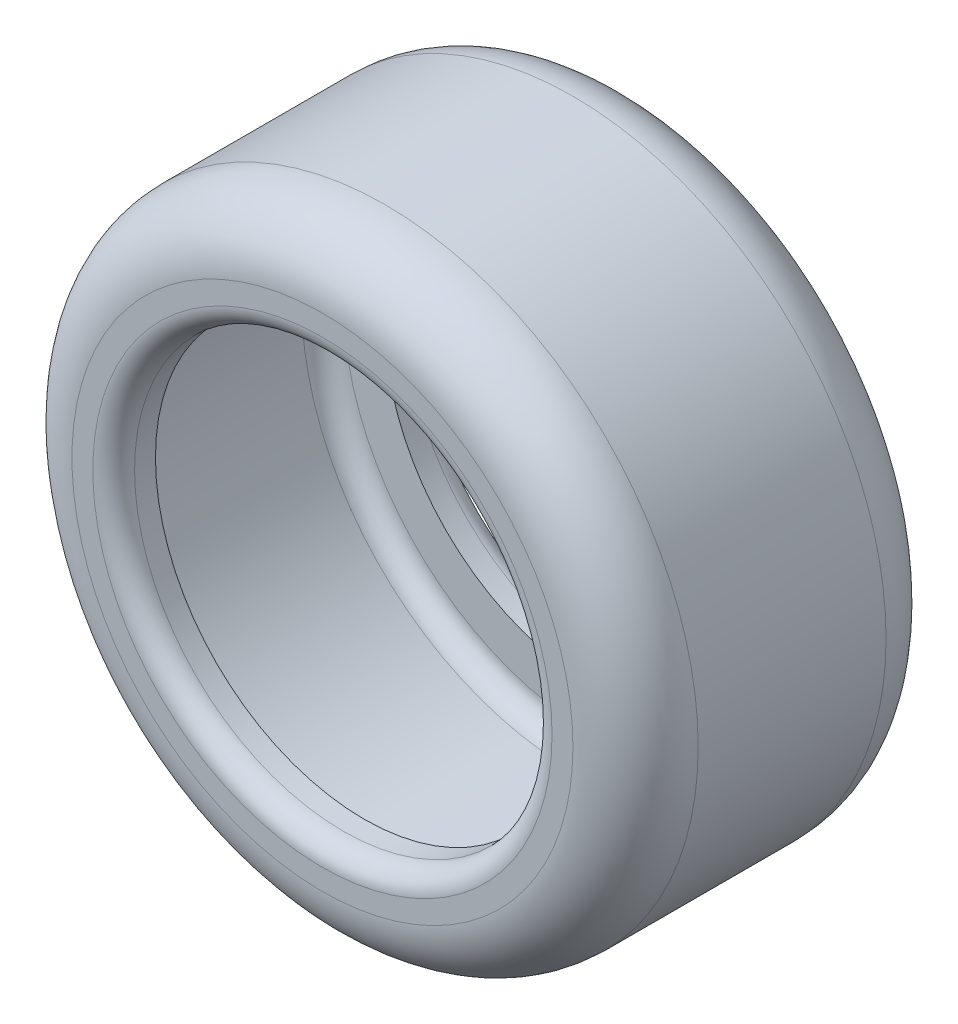
ISO-10303-21;
HEADER;
FILE_DESCRIPTION(('STEP AP214'),'2;1');
FILE_NAME('part.step','',(''),(''),'','','');
FILE_SCHEMA(('AUTOMOTIVE_DESIGN { 1 0 10303 214 1 1 1 1 }'));
ENDSEC;
DATA;
#1=APPLICATION_CONTEXT('core data for automotive mechanical design processes');
#2=APPLICATION_PROTOCOL_DEFINITION('international standard','automotive_design',2000,#1);
#3=PRODUCT_CONTEXT('',#1,'mechanical');
#4=PRODUCT('Part','Part','',(#3));
#5=PRODUCT_RELATED_PRODUCT_CATEGORY('part','',(#4));
#6=PRODUCT_DEFINITION_FORMATION('','',#4);
#7=PRODUCT_DEFINITION_CONTEXT('part definition',#1,'design');
#8=PRODUCT_DEFINITION('design','',#6,#7);
#9=PRODUCT_DEFINITION_SHAPE('','',#8);
#10=(LENGTH_UNIT() NAMED_UNIT(*) SI_UNIT(.MILLI.,.METRE.));
#11=(NAMED_UNIT(*) PLANE_ANGLE_UNIT() SI_UNIT($,.RADIAN.));
#12=(NAMED_UNIT(*) SI_UNIT($,.STERADIAN.) SOLID_ANGLE_UNIT());
#13=UNCERTAINTY_MEASURE_WITH_UNIT(LENGTH_MEASURE(1.E-05),#10,'distance_accuracy_value','');
#14=(GEOMETRIC_REPRESENTATION_CONTEXT(3) GLOBAL_UNCERTAINTY_ASSIGNED_CONTEXT((#13)) GLOBAL_UNIT_ASSIGNED_CONTEXT((#10,
#11,#12)) REPRESENTATION_CONTEXT('',''));
#15=CARTESIAN_POINT('',(0.,0.,0.));
#16=DIRECTION('',(0.,0.,1.));
#17=DIRECTION('',(1.,0.,0.));
#18=AXIS2_PLACEMENT_3D('',#15,#16,#17);
#19=CARTESIAN_POINT('',(-15.4340427457769,9.05911204643427,38.1));
#20=DIRECTION('',(0.,0.,-1.));
#21=DIRECTION('',(-1.,0.,0.));
#22=AXIS2_PLACEMENT_3D('',#19,#20,#21);
#23=CYLINDRICAL_SURFACE('',#22,25.4);
#24=CARTESIAN_POINT('',(-15.4340427457769,9.05911204643427,35.56));
#25=DIRECTION('',(0.,0.,1.));
#26=DIRECTION('',(1.,0.,0.));
#27=AXIS2_PLACEMENT_3D('',#24,#25,#26);
#28=CIRCLE('',#27,25.4);
#29=CARTESIAN_POINT('',(-40.8340427457769,9.05911204643427,35.56));
#30=VERTEX_POINT('',#29);
#31=EDGE_CURVE('E56',#30,#30,#28,.T.);
#32=CARTESIAN_POINT('',(-15.4340427457769,9.05911204643427,33.02));
#33=DIRECTION('',(0.,0.,1.));
#34=DIRECTION('',(1.,0.,0.));
#35=AXIS2_PLACEMENT_3D('',#32,#33,#34);
#36=CIRCLE('',#35,25.4);
#37=CARTESIAN_POINT('',(-40.8340427457769,9.05911204643427,33.02));
#38=VERTEX_POINT('',#37);
#39=EDGE_CURVE('E87',#38,#38,#36,.F.);
#40=CARTESIAN_POINT('',(-40.8340427457769,9.05911204643427,35.56));
#41=CARTESIAN_POINT('',(-40.8340427457769,9.05911204643427,35.5335416666667));
#42=CARTESIAN_POINT('',(-40.8340427457769,9.05911204643427,35.5070833333333));
#43=CARTESIAN_POINT('',(-40.8340427457769,9.05911204643427,35.4541666666667));
#44=CARTESIAN_POINT('',(-40.8340427457769,9.05911204643427,35.4277083333333));
#45=CARTESIAN_POINT('',(-40.8340427457769,9.05911204643427,35.3747916666667));
#46=CARTESIAN_POINT('',(-40.8340427457769,9.05911204643427,35.3483333333333));
#47=CARTESIAN_POINT('',(-40.8340427457769,9.05911204643427,35.2954166666667));
#48=CARTESIAN_POINT('',(-40.8340427457769,9.05911204643427,35.2689583333333));
#49=CARTESIAN_POINT('',(-40.8340427457769,9.05911204643427,35.2160416666667));
#50=CARTESIAN_POINT('',(-40.8340427457769,9.05911204643427,35.1895833333333));
#51=CARTESIAN_POINT('',(-40.8340427457769,9.05911204643427,35.1366666666667));
#52=CARTESIAN_POINT('',(-40.8340427457769,9.05911204643427,35.1102083333333));
#53=CARTESIAN_POINT('',(-40.8340427457769,9.05911204643427,35.0572916666667));
#54=CARTESIAN_POINT('',(-40.8340427457769,9.05911204643427,35.0308333333333));
#55=CARTESIAN_POINT('',(-40.8340427457769,9.05911204643427,34.9779166666667));
#56=CARTESIAN_POINT('',(-40.8340427457769,9.05911204643427,34.9514583333333));
#57=CARTESIAN_POINT('',(-40.8340427457769,9.05911204643427,34.8985416666667));
#58=CARTESIAN_POINT('',(-40.8340427457769,9.05911204643427,34.8720833333333));
#59=CARTESIAN_POINT('',(-40.8340427457769,9.05911204643427,34.8191666666667));
#60=CARTESIAN_POINT('',(-40.8340427457769,9.05911204643427,34.7927083333333));
#61=CARTESIAN_POINT('',(-40.8340427457769,9.05911204643427,34.7397916666667));
#62=CARTESIAN_POINT('',(-40.8340427457769,9.05911204643427,34.7133333333333));
#63=CARTESIAN_POINT('',(-40.8340427457769,9.05911204643427,34.6604166666667));
#64=CARTESIAN_POINT('',(-40.8340427457769,9.05911204643427,34.6339583333333));
#65=CARTESIAN_POINT('',(-40.8340427457769,9.05911204643427,34.5810416666667));
#66=CARTESIAN_POINT('',(-40.8340427457769,9.05911204643427,34.5545833333333));
#67=CARTESIAN_POINT('',(-40.8340427457769,9.05911204643427,34.5016666666667));
#68=CARTESIAN_POINT('',(-40.8340427457769,9.05911204643427,34.4752083333333));
#69=CARTESIAN_POINT('',(-40.8340427457769,9.05911204643427,34.4222916666667));
#70=CARTESIAN_POINT('',(-40.8340427457769,9.05911204643427,34.3958333333333));
#71=CARTESIAN_POINT('',(-40.8340427457769,9.05911204643427,34.3429166666667));
#72=CARTESIAN_POINT('',(-40.8340427457769,9.05911204643427,34.3164583333333));
#73=CARTESIAN_POINT('',(-40.8340427457769,9.05911204643427,34.2635416666667));
#74=CARTESIAN_POINT('',(-40.8340427457769,9.05911204643427,34.2370833333333));
#75=CARTESIAN_POINT('',(-40.8340427457769,9.05911204643427,34.1841666666667));
#76=CARTESIAN_POINT('',(-40.8340427457769,9.05911204643427,34.1577083333333));
#77=CARTESIAN_POINT('',(-40.8340427457769,9.05911204643427,34.1047916666667));
#78=CARTESIAN_POINT('',(-40.8340427457769,9.05911204643427,34.0783333333333));
#79=CARTESIAN_POINT('',(-40.8340427457769,9.05911204643427,34.0254166666667));
#80=CARTESIAN_POINT('',(-40.8340427457769,9.05911204643427,33.9989583333333));
#81=CARTESIAN_POINT('',(-40.8340427457769,9.05911204643427,33.9460416666667));
#82=CARTESIAN_POINT('',(-40.8340427457769,9.05911204643427,33.9195833333333));
#83=CARTESIAN_POINT('',(-40.8340427457769,9.05911204643427,33.8666666666667));
#84=CARTESIAN_POINT('',(-40.8340427457769,9.05911204643427,33.8402083333333));
#85=CARTESIAN_POINT('',(-40.8340427457769,9.05911204643427,33.7872916666667));
#86=CARTESIAN_POINT('',(-40.8340427457769,9.05911204643427,33.7608333333333));
#87=CARTESIAN_POINT('',(-40.8340427457769,9.05911204643427,33.7079166666667));
#88=CARTESIAN_POINT('',(-40.8340427457769,9.05911204643427,33.6814583333333));
#89=CARTESIAN_POINT('',(-40.8340427457769,9.05911204643427,33.6285416666667));
#90=CARTESIAN_POINT('',(-40.8340427457769,9.05911204643427,33.6020833333333));
#91=CARTESIAN_POINT('',(-40.8340427457769,9.05911204643427,33.5491666666667));
#92=CARTESIAN_POINT('',(-40.8340427457769,9.05911204643427,33.5227083333333));
#93=CARTESIAN_POINT('',(-40.8340427457769,9.05911204643427,33.4697916666667));
#94=CARTESIAN_POINT('',(-40.8340427457769,9.05911204643427,33.4433333333333));
#95=CARTESIAN_POINT('',(-40.8340427457769,9.05911204643427,33.3904166666667));
#96=CARTESIAN_POINT('',(-40.8340427457769,9.05911204643427,33.3639583333333));
#97=CARTESIAN_POINT('',(-40.8340427457769,9.05911204643427,33.3110416666667));
#98=CARTESIAN_POINT('',(-40.8340427457769,9.05911204643427,33.2845833333333));
#99=CARTESIAN_POINT('',(-40.8340427457769,9.05911204643427,33.2316666666667));
#100=CARTESIAN_POINT('',(-40.8340427457769,9.05911204643427,33.2052083333333));
#101=CARTESIAN_POINT('',(-40.8340427457769,9.05911204643427,33.1522916666667));
#102=CARTESIAN_POINT('',(-40.8340427457769,9.05911204643427,33.1258333333333));
#103=CARTESIAN_POINT('',(-40.8340427457769,9.05911204643427,33.0729166666667));
#104=CARTESIAN_POINT('',(-40.8340427457769,9.05911204643427,33.0464583333333));
#105=CARTESIAN_POINT('',(-40.8340427457769,9.05911204643427,33.02));
#106=B_SPLINE_CURVE_WITH_KNOTS('',3,(#40,#41,#42,#43,#44,#45,#46,#47,#48,#49,#50,#51,#52,#53,
#54,#55,#56,#57,#58,#59,#60,#61,#62,#63,#64,#65,#66,#67,#68,#69,#70,#71,#72,#73,#74,#75,#76,#77,
#78,#79,#80,#81,#82,#83,#84,#85,#86,#87,#88,#89,#90,#91,#92,#93,#94,#95,#96,#97,#98,#99,#100,
#101,#102,#103,#104,#105),.UNSPECIFIED.,.F.,.F.,(4,2,2,2,2,2,2,2,2,2,2,2,2,2,2,2,2,2,2,2,2,2,2,
2,2,2,2,2,2,2,2,2,4),(0.,0.0793749999999996,0.158750000000006,0.238125000000006,
0.317500000000005,0.396875000000005,0.476250000000004,0.555625000000004,0.635000000000004,
0.714375000000003,0.793750000000003,0.873125000000002,0.952500000000002,1.031875,1.11125,
1.190625,1.27,1.34937500000001,1.42875,1.50812500000001,1.58750000000001,1.66687500000001,
1.74625,1.825625,1.905,1.984375,2.06375,2.143125,2.2225,2.301875,2.38125,2.460625,2.54),.UNSPECIFIED.);
#107=EDGE_CURVE('BSEAM43',#30,#38,#106,.T.);
#108=ORIENTED_EDGE('',*,*,#31,.T.);
#109=ORIENTED_EDGE('',*,*,#39,.T.);
#110=ORIENTED_EDGE('',*,*,#107,.T.);
#111=ORIENTED_EDGE('',*,*,#107,.F.);
#112=EDGE_LOOP('',(#108,#110,#109,#111));
#113=FACE_BOUND('',#112,.T.);
#114=ADVANCED_FACE('F43',(#113),#23,.F.);
#115=CARTESIAN_POINT('',(-15.4340427457769,9.05911204643427,38.1));
#116=DIRECTION('',(0.,0.,1.));
#117=DIRECTION('',(1.,0.,0.));
#118=AXIS2_PLACEMENT_3D('',#115,#116,#117);
#119=PLANE('',#118);
#120=CARTESIAN_POINT('',(-15.4340427457769,9.05911204643427,38.1));
#121=DIRECTION('',(0.,0.,1.));
#122=DIRECTION('',(1.,0.,0.));
#123=AXIS2_PLACEMENT_3D('',#120,#121,#122);
#124=CIRCLE('',#123,27.94);
#125=CARTESIAN_POINT('',(12.5059572542231,9.05911204643427,38.1));
#126=VERTEX_POINT('',#125);
#127=EDGE_CURVE('E11',#126,#126,#124,.F.);
#128=ORIENTED_EDGE('',*,*,#127,.T.);
#129=EDGE_LOOP('',(#128));
#130=FACE_BOUND('',#129,.T.);
#131=CARTESIAN_POINT('',(-15.4340427457769,9.05911204643427,38.1));
#132=DIRECTION('',(0.,0.,1.));
#133=DIRECTION('',(1.,0.,0.));
#134=AXIS2_PLACEMENT_3D('',#131,#132,#133);
#135=CIRCLE('',#134,30.48);
#136=CARTESIAN_POINT('',(15.0459572542231,9.05911204643427,38.1));
#137=VERTEX_POINT('',#136);
#138=EDGE_CURVE('E67',#137,#137,#135,.T.);
#139=ORIENTED_EDGE('',*,*,#138,.T.);
#140=EDGE_LOOP('',(#139));
#141=FACE_BOUND('',#140,.T.);
#142=ADVANCED_FACE('F118',(#130,#141),#119,.T.);
#143=CARTESIAN_POINT('',(-15.4340427457769,9.05911204643427,0.));
#144=DIRECTION('',(0.,0.,1.));
#145=DIRECTION('',(1.,0.,0.));
#146=AXIS2_PLACEMENT_3D('',#143,#144,#145);
#147=PLANE('',#146);
#148=CARTESIAN_POINT('',(-15.4340427457769,9.05911204643427,0.));
#149=DIRECTION('',(0.,0.,1.));
#150=DIRECTION('',(1.,0.,0.));
#151=AXIS2_PLACEMENT_3D('',#148,#149,#150);
#152=CIRCLE('',#151,27.94);
#153=CARTESIAN_POINT('',(12.5059572542231,9.05911204643427,0.));
#154=VERTEX_POINT('',#153);
#155=EDGE_CURVE('E61',#154,#154,#152,.T.);
#156=ORIENTED_EDGE('',*,*,#155,.T.);
#157=EDGE_LOOP('',(#156));
#158=FACE_BOUND('',#157,.T.);
#159=CARTESIAN_POINT('',(-15.4340427457769,9.05911204643427,0.));
#160=DIRECTION('',(0.,0.,1.));
#161=DIRECTION('',(1.,0.,0.));
#162=AXIS2_PLACEMENT_3D('',#159,#160,#161);
#163=CIRCLE('',#162,30.48);
#164=CARTESIAN_POINT('',(15.0459572542231,9.05911204643427,0.));
#165=VERTEX_POINT('',#164);
#166=EDGE_CURVE('E71',#165,#165,#163,.F.);
#167=ORIENTED_EDGE('',*,*,#166,.T.);
#168=EDGE_LOOP('',(#167));
#169=FACE_BOUND('',#168,.T.);
#170=ADVANCED_FACE('F125',(#158,#169),#147,.F.);
#171=CARTESIAN_POINT('',(-15.4340427457769,9.05911204643427,38.1));
#172=DIRECTION('',(0.,0.,-1.));
#173=DIRECTION('',(-1.,0.,0.));
#174=AXIS2_PLACEMENT_3D('',#171,#172,#173);
#175=CYLINDRICAL_SURFACE('',#174,38.1);
#176=CARTESIAN_POINT('',(-15.4340427457769,9.05911204643427,7.61999999999999));
#177=DIRECTION('',(0.,0.,1.));
#178=DIRECTION('',(1.,0.,0.));
#179=AXIS2_PLACEMENT_3D('',#176,#177,#178);
#180=CIRCLE('',#179,38.1);
#181=CARTESIAN_POINT('',(-53.5340427457769,9.05911204643427,7.61999999999999));
#182=VERTEX_POINT('',#181);
#183=EDGE_CURVE('E75',#182,#182,#180,.T.);
#184=CARTESIAN_POINT('',(-15.4340427457769,9.05911204643427,30.48));
#185=DIRECTION('',(0.,0.,1.));
#186=DIRECTION('',(1.,0.,0.));
#187=AXIS2_PLACEMENT_3D('',#184,#185,#186);
#188=CIRCLE('',#187,38.1);
#189=CARTESIAN_POINT('',(-53.5340427457769,9.05911204643427,30.48));
#190=VERTEX_POINT('',#189);
#191=EDGE_CURVE('E79',#190,#190,#188,.F.);
#192=CARTESIAN_POINT('',(-53.5340427457769,9.05911204643427,7.61999999999999));
#193=CARTESIAN_POINT('',(-53.5340427457769,9.05911204643427,7.85812499999999));
#194=CARTESIAN_POINT('',(-53.5340427457769,9.05911204643427,8.09624999999999));
#195=CARTESIAN_POINT('',(-53.5340427457769,9.05911204643427,8.57249999999999));
#196=CARTESIAN_POINT('',(-53.5340427457769,9.05911204643427,8.81062499999999));
#197=CARTESIAN_POINT('',(-53.5340427457769,9.05911204643427,9.28687499999999));
#198=CARTESIAN_POINT('',(-53.5340427457769,9.05911204643427,9.52499999999999));
#199=CARTESIAN_POINT('',(-53.5340427457769,9.05911204643427,10.00125));
#200=CARTESIAN_POINT('',(-53.5340427457769,9.05911204643427,10.239375));
#201=CARTESIAN_POINT('',(-53.5340427457769,9.05911204643427,10.715625));
#202=CARTESIAN_POINT('',(-53.5340427457769,9.05911204643427,10.95375));
#203=CARTESIAN_POINT('',(-53.5340427457769,9.05911204643427,11.43));
#204=CARTESIAN_POINT('',(-53.5340427457769,9.05911204643427,11.668125));
#205=CARTESIAN_POINT('',(-53.5340427457769,9.05911204643427,12.144375));
#206=CARTESIAN_POINT('',(-53.5340427457769,9.05911204643427,12.3825));
#207=CARTESIAN_POINT('',(-53.5340427457769,9.05911204643427,12.85875));
#208=CARTESIAN_POINT('',(-53.5340427457769,9.05911204643427,13.096875));
#209=CARTESIAN_POINT('',(-53.5340427457769,9.05911204643427,13.573125));
#210=CARTESIAN_POINT('',(-53.5340427457769,9.05911204643427,13.81125));
#211=CARTESIAN_POINT('',(-53.5340427457769,9.05911204643427,14.2875));
#212=CARTESIAN_POINT('',(-53.5340427457769,9.05911204643427,14.525625));
#213=CARTESIAN_POINT('',(-53.5340427457769,9.05911204643427,15.001875));
#214=CARTESIAN_POINT('',(-53.5340427457769,9.05911204643427,15.24));
#215=CARTESIAN_POINT('',(-53.5340427457769,9.05911204643427,15.71625));
#216=CARTESIAN_POINT('',(-53.5340427457769,9.05911204643427,15.954375));
#217=CARTESIAN_POINT('',(-53.5340427457769,9.05911204643427,16.430625));
#218=CARTESIAN_POINT('',(-53.5340427457769,9.05911204643427,16.66875));
#219=CARTESIAN_POINT('',(-53.5340427457769,9.05911204643427,17.145));
#220=CARTESIAN_POINT('',(-53.5340427457769,9.05911204643427,17.383125));
#221=CARTESIAN_POINT('',(-53.5340427457769,9.05911204643427,17.859375));
#222=CARTESIAN_POINT('',(-53.5340427457769,9.05911204643427,18.0975));
#223=CARTESIAN_POINT('',(-53.5340427457769,9.05911204643427,18.57375));
#224=CARTESIAN_POINT('',(-53.5340427457769,9.05911204643427,18.811875));
#225=CARTESIAN_POINT('',(-53.5340427457769,9.05911204643427,19.288125));
#226=CARTESIAN_POINT('',(-53.5340427457769,9.05911204643427,19.52625));
#227=CARTESIAN_POINT('',(-53.5340427457769,9.05911204643427,20.0025));
#228=CARTESIAN_POINT('',(-53.5340427457769,9.05911204643427,20.240625));
#229=CARTESIAN_POINT('',(-53.5340427457769,9.05911204643427,20.716875));
#230=CARTESIAN_POINT('',(-53.5340427457769,9.05911204643427,20.955));
#231=CARTESIAN_POINT('',(-53.5340427457769,9.05911204643427,21.43125));
#232=CARTESIAN_POINT('',(-53.5340427457769,9.05911204643427,21.669375));
#233=CARTESIAN_POINT('',(-53.5340427457769,9.05911204643427,22.145625));
#234=CARTESIAN_POINT('',(-53.5340427457769,9.05911204643427,22.38375));
#235=CARTESIAN_POINT('',(-53.5340427457769,9.05911204643427,22.86));
#236=CARTESIAN_POINT('',(-53.5340427457769,9.05911204643427,23.098125));
#237=CARTESIAN_POINT('',(-53.5340427457769,9.05911204643427,23.574375));
#238=CARTESIAN_POINT('',(-53.5340427457769,9.05911204643427,23.8125));
#239=CARTESIAN_POINT('',(-53.5340427457769,9.05911204643427,24.28875));
#240=CARTESIAN_POINT('',(-53.5340427457769,9.05911204643427,24.526875));
#241=CARTESIAN_POINT('',(-53.5340427457769,9.05911204643427,25.003125));
#242=CARTESIAN_POINT('',(-53.5340427457769,9.05911204643427,25.24125));
#243=CARTESIAN_POINT('',(-53.5340427457769,9.05911204643427,25.7175));
#244=CARTESIAN_POINT('',(-53.5340427457769,9.05911204643427,25.955625));
#245=CARTESIAN_POINT('',(-53.5340427457769,9.05911204643427,26.431875));
#246=CARTESIAN_POINT('',(-53.5340427457769,9.05911204643427,26.67));
#247=CARTESIAN_POINT('',(-53.5340427457769,9.05911204643427,27.14625));
#248=CARTESIAN_POINT('',(-53.5340427457769,9.05911204643427,27.384375));
#249=CARTESIAN_POINT('',(-53.5340427457769,9.05911204643427,27.860625));
#250=CARTESIAN_POINT('',(-53.5340427457769,9.05911204643427,28.09875));
#251=CARTESIAN_POINT('',(-53.5340427457769,9.05911204643427,28.575));
#252=CARTESIAN_POINT('',(-53.5340427457769,9.05911204643427,28.813125));
#253=CARTESIAN_POINT('',(-53.5340427457769,9.05911204643427,29.289375));
#254=CARTESIAN_POINT('',(-53.5340427457769,9.05911204643427,29.5275));
#255=CARTESIAN_POINT('',(-53.5340427457769,9.05911204643427,30.00375));
#256=CARTESIAN_POINT('',(-53.5340427457769,9.05911204643427,30.241875));
#257=CARTESIAN_POINT('',(-53.5340427457769,9.05911204643427,30.48));
#258=B_SPLINE_CURVE_WITH_KNOTS('',3,(#192,#193,#194,#195,#196,#197,#198,#199,#200,#201,#202,
#203,#204,#205,#206,#207,#208,#209,#210,#211,#212,#213,#214,#215,#216,#217,#218,#219,#220,#221,
#222,#223,#224,#225,#226,#227,#228,#229,#230,#231,#232,#233,#234,#235,#236,#237,#238,#239,#240,
#241,#242,#243,#244,#245,#246,#247,#248,#249,#250,#251,#252,#253,#254,#255,#256,#257),
.UNSPECIFIED.,.F.,.F.,(4,2,2,2,2,2,2,2,2,2,2,2,2,2,2,2,2,2,2,2,2,2,2,2,2,2,2,2,2,2,2,2,4),(0.,
0.714375,1.42875,2.143125,2.8575,3.571875,4.28625,5.000625,5.71500000000001,6.429375,7.14375,
7.858125,8.5725,9.28687500000001,10.00125,10.715625,11.43,12.144375,12.85875,13.573125,14.2875,
15.001875,15.71625,16.430625,17.145,17.859375,18.57375,19.288125,20.0025,20.716875,21.43125,
22.145625,22.86),.UNSPECIFIED.);
#259=EDGE_CURVE('BSEAM130',#182,#190,#258,.T.);
#260=ORIENTED_EDGE('',*,*,#183,.T.);
#261=ORIENTED_EDGE('',*,*,#191,.T.);
#262=ORIENTED_EDGE('',*,*,#259,.T.);
#263=ORIENTED_EDGE('',*,*,#259,.F.);
#264=EDGE_LOOP('',(#260,#262,#261,#263));
#265=FACE_BOUND('',#264,.T.);
#266=ADVANCED_FACE('F130',(#265),#175,.T.);
#267=CARTESIAN_POINT('',(-15.4340427457769,9.05911204643427,5.08));
#268=DIRECTION('',(0.,0.,1.));
#269=DIRECTION('',(1.,0.,0.));
#270=AXIS2_PLACEMENT_3D('',#267,#268,#269);
#271=CIRCLE('',#270,25.4);
#272=CARTESIAN_POINT('',(-40.8340427457769,9.05911204643427,5.08));
#273=VERTEX_POINT('',#272);
#274=EDGE_CURVE('E83',#273,#273,#271,.F.);
#275=CARTESIAN_POINT('',(-15.4340427457769,9.05911204643427,2.54));
#276=DIRECTION('',(0.,0.,1.));
#277=DIRECTION('',(1.,0.,0.));
#278=AXIS2_PLACEMENT_3D('',#275,#276,#277);
#279=CIRCLE('',#278,25.4);
#280=CARTESIAN_POINT('',(-40.8340427457769,9.05911204643427,2.54));
#281=VERTEX_POINT('',#280);
#282=EDGE_CURVE('E51',#281,#281,#279,.F.);
#283=CARTESIAN_POINT('',(-40.8340427457769,9.05911204643427,5.08));
#284=CARTESIAN_POINT('',(-40.8340427457769,9.05911204643427,5.05354166666667));
#285=CARTESIAN_POINT('',(-40.8340427457769,9.05911204643427,5.02708333333333));
#286=CARTESIAN_POINT('',(-40.8340427457769,9.05911204643427,4.97416666666667));
#287=CARTESIAN_POINT('',(-40.8340427457769,9.05911204643427,4.94770833333334));
#288=CARTESIAN_POINT('',(-40.8340427457769,9.05911204643427,4.89479166666667));
#289=CARTESIAN_POINT('',(-40.8340427457769,9.05911204643427,4.86833333333334));
#290=CARTESIAN_POINT('',(-40.8340427457769,9.05911204643427,4.81541666666667));
#291=CARTESIAN_POINT('',(-40.8340427457769,9.05911204643427,4.78895833333334));
#292=CARTESIAN_POINT('',(-40.8340427457769,9.05911204643427,4.73604166666667));
#293=CARTESIAN_POINT('',(-40.8340427457769,9.05911204643427,4.70958333333334));
#294=CARTESIAN_POINT('',(-40.8340427457769,9.05911204643427,4.65666666666667));
#295=CARTESIAN_POINT('',(-40.8340427457769,9.05911204643427,4.63020833333334));
#296=CARTESIAN_POINT('',(-40.8340427457769,9.05911204643427,4.57729166666667));
#297=CARTESIAN_POINT('',(-40.8340427457769,9.05911204643427,4.55083333333334));
#298=CARTESIAN_POINT('',(-40.8340427457769,9.05911204643427,4.49791666666667));
#299=CARTESIAN_POINT('',(-40.8340427457769,9.05911204643427,4.47145833333334));
#300=CARTESIAN_POINT('',(-40.8340427457769,9.05911204643427,4.41854166666667));
#301=CARTESIAN_POINT('',(-40.8340427457769,9.05911204643427,4.39208333333333));
#302=CARTESIAN_POINT('',(-40.8340427457769,9.05911204643427,4.33916666666666));
#303=CARTESIAN_POINT('',(-40.8340427457769,9.05911204643427,4.31270833333333));
#304=CARTESIAN_POINT('',(-40.8340427457769,9.05911204643427,4.25979166666666));
#305=CARTESIAN_POINT('',(-40.8340427457769,9.05911204643427,4.23333333333333));
#306=CARTESIAN_POINT('',(-40.8340427457769,9.05911204643427,4.18041666666667));
#307=CARTESIAN_POINT('',(-40.8340427457769,9.05911204643427,4.15395833333333));
#308=CARTESIAN_POINT('',(-40.8340427457769,9.05911204643427,4.10104166666667));
#309=CARTESIAN_POINT('',(-40.8340427457769,9.05911204643427,4.07458333333333));
#310=CARTESIAN_POINT('',(-40.8340427457769,9.05911204643427,4.02166666666667));
#311=CARTESIAN_POINT('',(-40.8340427457769,9.05911204643427,3.99520833333333));
#312=CARTESIAN_POINT('',(-40.8340427457769,9.05911204643427,3.94229166666667));
#313=CARTESIAN_POINT('',(-40.8340427457769,9.05911204643427,3.91583333333333));
#314=CARTESIAN_POINT('',(-40.8340427457769,9.05911204643427,3.86291666666667));
#315=CARTESIAN_POINT('',(-40.8340427457769,9.05911204643427,3.83645833333333));
#316=CARTESIAN_POINT('',(-40.8340427457769,9.05911204643427,3.78354166666667));
#317=CARTESIAN_POINT('',(-40.8340427457769,9.05911204643427,3.75708333333333));
#318=CARTESIAN_POINT('',(-40.8340427457769,9.05911204643427,3.70416666666667));
#319=CARTESIAN_POINT('',(-40.8340427457769,9.05911204643427,3.67770833333334));
#320=CARTESIAN_POINT('',(-40.8340427457769,9.05911204643427,3.62479166666667));
#321=CARTESIAN_POINT('',(-40.8340427457769,9.05911204643427,3.59833333333334));
#322=CARTESIAN_POINT('',(-40.8340427457769,9.05911204643427,3.54541666666667));
#323=CARTESIAN_POINT('',(-40.8340427457769,9.05911204643427,3.51895833333334));
#324=CARTESIAN_POINT('',(-40.8340427457769,9.05911204643427,3.46604166666667));
#325=CARTESIAN_POINT('',(-40.8340427457769,9.05911204643427,3.43958333333334));
#326=CARTESIAN_POINT('',(-40.8340427457769,9.05911204643427,3.38666666666667));
#327=CARTESIAN_POINT('',(-40.8340427457769,9.05911204643427,3.36020833333334));
#328=CARTESIAN_POINT('',(-40.8340427457769,9.05911204643427,3.30729166666667));
#329=CARTESIAN_POINT('',(-40.8340427457769,9.05911204643427,3.28083333333334));
#330=CARTESIAN_POINT('',(-40.8340427457769,9.05911204643427,3.22791666666667));
#331=CARTESIAN_POINT('',(-40.8340427457769,9.05911204643427,3.20145833333333));
#332=CARTESIAN_POINT('',(-40.8340427457769,9.05911204643427,3.14854166666666));
#333=CARTESIAN_POINT('',(-40.8340427457769,9.05911204643427,3.12208333333333));
#334=CARTESIAN_POINT('',(-40.8340427457769,9.05911204643427,3.06916666666666));
#335=CARTESIAN_POINT('',(-40.8340427457769,9.05911204643427,3.04270833333333));
#336=CARTESIAN_POINT('',(-40.8340427457769,9.05911204643427,2.98979166666666));
#337=CARTESIAN_POINT('',(-40.8340427457769,9.05911204643427,2.96333333333333));
#338=CARTESIAN_POINT('',(-40.8340427457769,9.05911204643427,2.91041666666667));
#339=CARTESIAN_POINT('',(-40.8340427457769,9.05911204643427,2.88395833333333));
#340=CARTESIAN_POINT('',(-40.8340427457769,9.05911204643427,2.83104166666667));
#341=CARTESIAN_POINT('',(-40.8340427457769,9.05911204643427,2.80458333333333));
#342=CARTESIAN_POINT('',(-40.8340427457769,9.05911204643427,2.75166666666667));
#343=CARTESIAN_POINT('',(-40.8340427457769,9.05911204643427,2.72520833333333));
#344=CARTESIAN_POINT('',(-40.8340427457769,9.05911204643427,2.67229166666667));
#345=CARTESIAN_POINT('',(-40.8340427457769,9.05911204643427,2.64583333333333));
#346=CARTESIAN_POINT('',(-40.8340427457769,9.05911204643427,2.59291666666667));
#347=CARTESIAN_POINT('',(-40.8340427457769,9.05911204643427,2.56645833333333));
#348=CARTESIAN_POINT('',(-40.8340427457769,9.05911204643427,2.54));
#349=B_SPLINE_CURVE_WITH_KNOTS('',3,(#283,#284,#285,#286,#287,#288,#289,#290,#291,#292,#293,
#294,#295,#296,#297,#298,#299,#300,#301,#302,#303,#304,#305,#306,#307,#308,#309,#310,#311,#312,
#313,#314,#315,#316,#317,#318,#319,#320,#321,#322,#323,#324,#325,#326,#327,#328,#329,#330,#331,
#332,#333,#334,#335,#336,#337,#338,#339,#340,#341,#342,#343,#344,#345,#346,#347,#348),
.UNSPECIFIED.,.F.,.F.,(4,2,2,2,2,2,2,2,2,2,2,2,2,2,2,2,2,2,2,2,2,2,2,2,2,2,2,2,2,2,2,2,4),(0.,
0.0793749999999996,0.158749999999999,0.238124999999999,0.317499999999998,0.396874999999998,
0.476249999999998,0.555624999999997,0.634999999999997,0.714375000000003,0.793750000000003,
0.873125000000002,0.952500000000002,1.031875,1.11125,1.190625,1.27,1.349375,1.42875,1.508125,
1.5875,1.666875,1.74625,1.825625,1.905,1.984375,2.06375,2.143125,2.2225,2.301875,2.38125,
2.460625,2.54),.UNSPECIFIED.);
#350=EDGE_CURVE('BSEAM121',#273,#281,#349,.T.);
#351=ORIENTED_EDGE('',*,*,#274,.F.);
#352=ORIENTED_EDGE('',*,*,#282,.T.);
#353=ORIENTED_EDGE('',*,*,#350,.T.);
#354=ORIENTED_EDGE('',*,*,#350,.F.);
#355=EDGE_LOOP('',(#351,#353,#352,#354));
#356=FACE_BOUND('',#355,.T.);
#357=ADVANCED_FACE('F121',(#356),#23,.F.);
#358=CARTESIAN_POINT('',(-15.4340427457769,9.05911204643427,7.62));
#359=DIRECTION('',(0.,0.,1.));
#360=DIRECTION('',(1.,0.,0.));
#361=AXIS2_PLACEMENT_3D('',#358,#359,#360);
#362=TOROIDAL_SURFACE('',#361,30.48,7.62);
#363=ORIENTED_EDGE('',*,*,#166,.F.);
#364=EDGE_LOOP('',(#363));
#365=FACE_BOUND('',#364,.T.);
#366=ORIENTED_EDGE('',*,*,#183,.F.);
#367=EDGE_LOOP('',(#366));
#368=FACE_BOUND('',#367,.T.);
#369=ADVANCED_FACE('F129',(#365,#368),#362,.T.);
#370=CARTESIAN_POINT('',(-15.4340427457769,9.05911204643427,30.48));
#371=DIRECTION('',(0.,0.,1.));
#372=DIRECTION('',(1.,0.,0.));
#373=AXIS2_PLACEMENT_3D('',#370,#371,#372);
#374=TOROIDAL_SURFACE('',#373,30.48,7.62);
#375=ORIENTED_EDGE('',*,*,#191,.F.);
#376=EDGE_LOOP('',(#375));
#377=FACE_BOUND('',#376,.T.);
#378=ORIENTED_EDGE('',*,*,#138,.F.);
#379=EDGE_LOOP('',(#378));
#380=FACE_BOUND('',#379,.T.);
#381=ADVANCED_FACE('F136',(#377,#380),#374,.T.);
#382=CARTESIAN_POINT('',(-15.4340427457769,9.05911204643427,2.54));
#383=DIRECTION('',(0.,0.,1.));
#384=DIRECTION('',(1.,0.,0.));
#385=AXIS2_PLACEMENT_3D('',#382,#383,#384);
#386=TOROIDAL_SURFACE('',#385,27.94,2.54);
#387=ORIENTED_EDGE('',*,*,#282,.F.);
#388=EDGE_LOOP('',(#387));
#389=FACE_BOUND('',#388,.T.);
#390=ORIENTED_EDGE('',*,*,#155,.F.);
#391=EDGE_LOOP('',(#390));
#392=FACE_BOUND('',#391,.T.);
#393=ADVANCED_FACE('F200',(#389,#392),#386,.T.);
#394=CARTESIAN_POINT('',(-15.4340427457769,9.05911204643427,35.56));
#395=DIRECTION('',(0.,0.,1.));
#396=DIRECTION('',(1.,0.,0.));
#397=AXIS2_PLACEMENT_3D('',#394,#395,#396);
#398=TOROIDAL_SURFACE('',#397,27.94,2.54);
#399=ORIENTED_EDGE('',*,*,#127,.F.);
#400=EDGE_LOOP('',(#399));
#401=FACE_BOUND('',#400,.T.);
#402=ORIENTED_EDGE('',*,*,#31,.F.);
#403=EDGE_LOOP('',(#402));
#404=FACE_BOUND('',#403,.T.);
#405=ADVANCED_FACE('F45',(#401,#404),#398,.T.);
#406=CARTESIAN_POINT('',(-15.4340427457769,9.05911204643427,33.02));
#407=DIRECTION('',(0.,0.,1.));
#408=DIRECTION('',(1.,0.,0.));
#409=AXIS2_PLACEMENT_3D('',#406,#407,#408);
#410=PLANE('',#409);
#411=CARTESIAN_POINT('',(-15.4340427457769,9.05911204643427,33.02));
#412=DIRECTION('',(0.,0.,1.));
#413=DIRECTION('',(1.,0.,0.));
#414=AXIS2_PLACEMENT_3D('',#411,#412,#413);
#415=CIRCLE('',#414,30.48);
#416=CARTESIAN_POINT('',(15.0459572542231,9.05911204643427,33.02));
#417=VERTEX_POINT('',#416);
#418=EDGE_CURVE('E91',#417,#417,#415,.T.);
#419=ORIENTED_EDGE('',*,*,#418,.F.);
#420=EDGE_LOOP('',(#419));
#421=FACE_BOUND('',#420,.T.);
#422=ORIENTED_EDGE('',*,*,#39,.F.);
#423=EDGE_LOOP('',(#422));
#424=FACE_BOUND('',#423,.T.);
#425=ADVANCED_FACE('F110',(#421,#424),#410,.F.);
#426=CARTESIAN_POINT('',(-15.4340427457769,9.05911204643427,5.08));
#427=DIRECTION('',(0.,0.,1.));
#428=DIRECTION('',(1.,0.,0.));
#429=AXIS2_PLACEMENT_3D('',#426,#427,#428);
#430=PLANE('',#429);
#431=CARTESIAN_POINT('',(-15.4340427457769,9.05911204643427,5.08));
#432=DIRECTION('',(0.,0.,1.));
#433=DIRECTION('',(1.,0.,0.));
#434=AXIS2_PLACEMENT_3D('',#431,#432,#433);
#435=CIRCLE('',#434,30.48);
#436=CARTESIAN_POINT('',(15.0459572542231,9.05911204643427,5.08));
#437=VERTEX_POINT('',#436);
#438=EDGE_CURVE('E92',#437,#437,#435,.F.);
#439=ORIENTED_EDGE('',*,*,#438,.F.);
#440=EDGE_LOOP('',(#439));
#441=FACE_BOUND('',#440,.T.);
#442=ORIENTED_EDGE('',*,*,#274,.T.);
#443=EDGE_LOOP('',(#442));
#444=FACE_BOUND('',#443,.T.);
#445=ADVANCED_FACE('F113',(#441,#444),#430,.T.);
#446=CARTESIAN_POINT('',(-15.4340427457769,9.05911204643427,38.1));
#447=DIRECTION('',(0.,0.,-1.));
#448=DIRECTION('',(-1.,0.,0.));
#449=AXIS2_PLACEMENT_3D('',#446,#447,#448);
#450=CYLINDRICAL_SURFACE('',#449,33.02);
#451=CARTESIAN_POINT('',(-15.4340427457769,9.05911204643427,7.62));
#452=DIRECTION('',(0.,0.,-1.));
#453=DIRECTION('',(-1.,0.,0.));
#454=AXIS2_PLACEMENT_3D('',#451,#452,#453);
#455=CIRCLE('',#454,33.02);
#456=CARTESIAN_POINT('',(-48.4540427457769,9.05911204643427,7.62000000000001));
#457=VERTEX_POINT('',#456);
#458=EDGE_CURVE('E96',#457,#457,#455,.F.);
#459=CARTESIAN_POINT('',(-15.4340427457769,9.05911204643427,30.48));
#460=DIRECTION('',(0.,0.,-1.));
#461=DIRECTION('',(-1.,0.,0.));
#462=AXIS2_PLACEMENT_3D('',#459,#460,#461);
#463=CIRCLE('',#462,33.02);
#464=CARTESIAN_POINT('',(-48.4540427457769,9.05911204643427,30.48));
#465=VERTEX_POINT('',#464);
#466=EDGE_CURVE('E100',#465,#465,#463,.T.);
#467=CARTESIAN_POINT('',(-48.4540427457769,9.05911204643427,7.62000000000001));
#468=CARTESIAN_POINT('',(-48.4540427457769,9.05911204643427,7.85812500000001));
#469=CARTESIAN_POINT('',(-48.4540427457769,9.05911204643427,8.09625));
#470=CARTESIAN_POINT('',(-48.4540427457769,9.05911204643427,8.57250000000001));
#471=CARTESIAN_POINT('',(-48.4540427457769,9.05911204643427,8.810625));
#472=CARTESIAN_POINT('',(-48.4540427457769,9.05911204643427,9.28687500000001));
#473=CARTESIAN_POINT('',(-48.4540427457769,9.05911204643427,9.525));
#474=CARTESIAN_POINT('',(-48.4540427457769,9.05911204643427,10.00125));
#475=CARTESIAN_POINT('',(-48.4540427457769,9.05911204643427,10.239375));
#476=CARTESIAN_POINT('',(-48.4540427457769,9.05911204643427,10.715625));
#477=CARTESIAN_POINT('',(-48.4540427457769,9.05911204643427,10.95375));
#478=CARTESIAN_POINT('',(-48.4540427457769,9.05911204643427,11.43));
#479=CARTESIAN_POINT('',(-48.4540427457769,9.05911204643427,11.668125));
#480=CARTESIAN_POINT('',(-48.4540427457769,9.05911204643427,12.144375));
#481=CARTESIAN_POINT('',(-48.4540427457769,9.05911204643427,12.3825));
#482=CARTESIAN_POINT('',(-48.4540427457769,9.05911204643427,12.85875));
#483=CARTESIAN_POINT('',(-48.4540427457769,9.05911204643427,13.096875));
#484=CARTESIAN_POINT('',(-48.4540427457769,9.05911204643427,13.573125));
#485=CARTESIAN_POINT('',(-48.4540427457769,9.05911204643427,13.81125));
#486=CARTESIAN_POINT('',(-48.4540427457769,9.05911204643427,14.2875));
#487=CARTESIAN_POINT('',(-48.4540427457769,9.05911204643427,14.525625));
#488=CARTESIAN_POINT('',(-48.4540427457769,9.05911204643427,15.001875));
#489=CARTESIAN_POINT('',(-48.4540427457769,9.05911204643427,15.24));
#490=CARTESIAN_POINT('',(-48.4540427457769,9.05911204643427,15.71625));
#491=CARTESIAN_POINT('',(-48.4540427457769,9.05911204643427,15.954375));
#492=CARTESIAN_POINT('',(-48.4540427457769,9.05911204643427,16.430625));
#493=CARTESIAN_POINT('',(-48.4540427457769,9.05911204643427,16.66875));
#494=CARTESIAN_POINT('',(-48.4540427457769,9.05911204643427,17.145));
#495=CARTESIAN_POINT('',(-48.4540427457769,9.05911204643427,17.383125));
#496=CARTESIAN_POINT('',(-48.4540427457769,9.05911204643427,17.859375));
#497=CARTESIAN_POINT('',(-48.4540427457769,9.05911204643427,18.0975));
#498=CARTESIAN_POINT('',(-48.4540427457769,9.05911204643427,18.57375));
#499=CARTESIAN_POINT('',(-48.4540427457769,9.05911204643427,18.811875));
#500=CARTESIAN_POINT('',(-48.4540427457769,9.05911204643427,19.288125));
#501=CARTESIAN_POINT('',(-48.4540427457769,9.05911204643427,19.52625));
#502=CARTESIAN_POINT('',(-48.4540427457769,9.05911204643427,20.0025));
#503=CARTESIAN_POINT('',(-48.4540427457769,9.05911204643427,20.240625));
#504=CARTESIAN_POINT('',(-48.4540427457769,9.05911204643427,20.716875));
#505=CARTESIAN_POINT('',(-48.4540427457769,9.05911204643427,20.955));
#506=CARTESIAN_POINT('',(-48.4540427457769,9.05911204643427,21.43125));
#507=CARTESIAN_POINT('',(-48.4540427457769,9.05911204643427,21.669375));
#508=CARTESIAN_POINT('',(-48.4540427457769,9.05911204643427,22.145625));
#509=CARTESIAN_POINT('',(-48.4540427457769,9.05911204643427,22.38375));
#510=CARTESIAN_POINT('',(-48.4540427457769,9.05911204643427,22.86));
#511=CARTESIAN_POINT('',(-48.4540427457769,9.05911204643427,23.098125));
#512=CARTESIAN_POINT('',(-48.4540427457769,9.05911204643427,23.574375));
#513=CARTESIAN_POINT('',(-48.4540427457769,9.05911204643427,23.8125));
#514=CARTESIAN_POINT('',(-48.4540427457769,9.05911204643427,24.28875));
#515=CARTESIAN_POINT('',(-48.4540427457769,9.05911204643427,24.526875));
#516=CARTESIAN_POINT('',(-48.4540427457769,9.05911204643427,25.003125));
#517=CARTESIAN_POINT('',(-48.4540427457769,9.05911204643427,25.24125));
#518=CARTESIAN_POINT('',(-48.4540427457769,9.05911204643427,25.7175));
#519=CARTESIAN_POINT('',(-48.4540427457769,9.05911204643427,25.955625));
#520=CARTESIAN_POINT('',(-48.4540427457769,9.05911204643427,26.431875));
#521=CARTESIAN_POINT('',(-48.4540427457769,9.05911204643427,26.67));
#522=CARTESIAN_POINT('',(-48.4540427457769,9.05911204643427,27.14625));
#523=CARTESIAN_POINT('',(-48.4540427457769,9.05911204643427,27.384375));
#524=CARTESIAN_POINT('',(-48.4540427457769,9.05911204643427,27.860625));
#525=CARTESIAN_POINT('',(-48.4540427457769,9.05911204643427,28.09875));
#526=CARTESIAN_POINT('',(-48.4540427457769,9.05911204643427,28.575));
#527=CARTESIAN_POINT('',(-48.4540427457769,9.05911204643427,28.813125));
#528=CARTESIAN_POINT('',(-48.4540427457769,9.05911204643427,29.289375));
#529=CARTESIAN_POINT('',(-48.4540427457769,9.05911204643427,29.5275));
#530=CARTESIAN_POINT('',(-48.4540427457769,9.05911204643427,30.00375));
#531=CARTESIAN_POINT('',(-48.4540427457769,9.05911204643427,30.241875));
#532=CARTESIAN_POINT('',(-48.4540427457769,9.05911204643427,30.48));
#533=B_SPLINE_CURVE_WITH_KNOTS('',3,(#467,#468,#469,#470,#471,#472,#473,#474,#475,#476,#477,
#478,#479,#480,#481,#482,#483,#484,#485,#486,#487,#488,#489,#490,#491,#492,#493,#494,#495,#496,
#497,#498,#499,#500,#501,#502,#503,#504,#505,#506,#507,#508,#509,#510,#511,#512,#513,#514,#515,
#516,#517,#518,#519,#520,#521,#522,#523,#524,#525,#526,#527,#528,#529,#530,#531,#532),
.UNSPECIFIED.,.F.,.F.,(4,2,2,2,2,2,2,2,2,2,2,2,2,2,2,2,2,2,2,2,2,2,2,2,2,2,2,2,2,2,2,2,4),(0.,
0.714375,1.42875,2.143125,2.8575,3.571875,4.28625,5.000625,5.715,6.429375,7.14375,7.858125,
8.5725,9.286875,10.00125,10.715625,11.43,12.144375,12.85875,13.573125,14.2875,15.001875,
15.71625,16.430625,17.145,17.859375,18.57375,19.288125,20.0025,20.716875,21.43125,22.145625,
22.86),.UNSPECIFIED.);
#534=EDGE_CURVE('BSEAM144',#457,#465,#533,.T.);
#535=ORIENTED_EDGE('',*,*,#458,.F.);
#536=ORIENTED_EDGE('',*,*,#466,.F.);
#537=ORIENTED_EDGE('',*,*,#534,.T.);
#538=ORIENTED_EDGE('',*,*,#534,.F.);
#539=EDGE_LOOP('',(#535,#537,#536,#538));
#540=FACE_BOUND('',#539,.T.);
#541=ADVANCED_FACE('F144',(#540),#450,.F.);
#542=CARTESIAN_POINT('',(-15.4340427457769,9.05911204643427,7.62));
#543=DIRECTION('',(0.,0.,1.));
#544=DIRECTION('',(1.,0.,0.));
#545=AXIS2_PLACEMENT_3D('',#542,#543,#544);
#546=TOROIDAL_SURFACE('',#545,30.48,2.54);
#547=ORIENTED_EDGE('',*,*,#438,.T.);
#548=EDGE_LOOP('',(#547));
#549=FACE_BOUND('',#548,.T.);
#550=ORIENTED_EDGE('',*,*,#458,.T.);
#551=EDGE_LOOP('',(#550));
#552=FACE_BOUND('',#551,.T.);
#553=ADVANCED_FACE('F150',(#549,#552),#546,.F.);
#554=CARTESIAN_POINT('',(-15.4340427457769,9.05911204643427,30.48));
#555=DIRECTION('',(0.,0.,1.));
#556=DIRECTION('',(1.,0.,0.));
#557=AXIS2_PLACEMENT_3D('',#554,#555,#556);
#558=TOROIDAL_SURFACE('',#557,30.48,2.54);
#559=ORIENTED_EDGE('',*,*,#466,.T.);
#560=EDGE_LOOP('',(#559));
#561=FACE_BOUND('',#560,.T.);
#562=ORIENTED_EDGE('',*,*,#418,.T.);
#563=EDGE_LOOP('',(#562));
#564=FACE_BOUND('',#563,.T.);
#565=ADVANCED_FACE('F108',(#561,#564),#558,.F.);
#566=CLOSED_SHELL('',(#114,#142,#170,#266,#357,#369,#381,#393,#405,#425,#445,#541,#553,#565));
#567=MANIFOLD_SOLID_BREP('B2',#566);
#568=ADVANCED_BREP_SHAPE_REPRESENTATION('',(#18,#567),#14);
#569=SHAPE_DEFINITION_REPRESENTATION(#9,#568);
ENDSEC;
END-ISO-10303-21;
